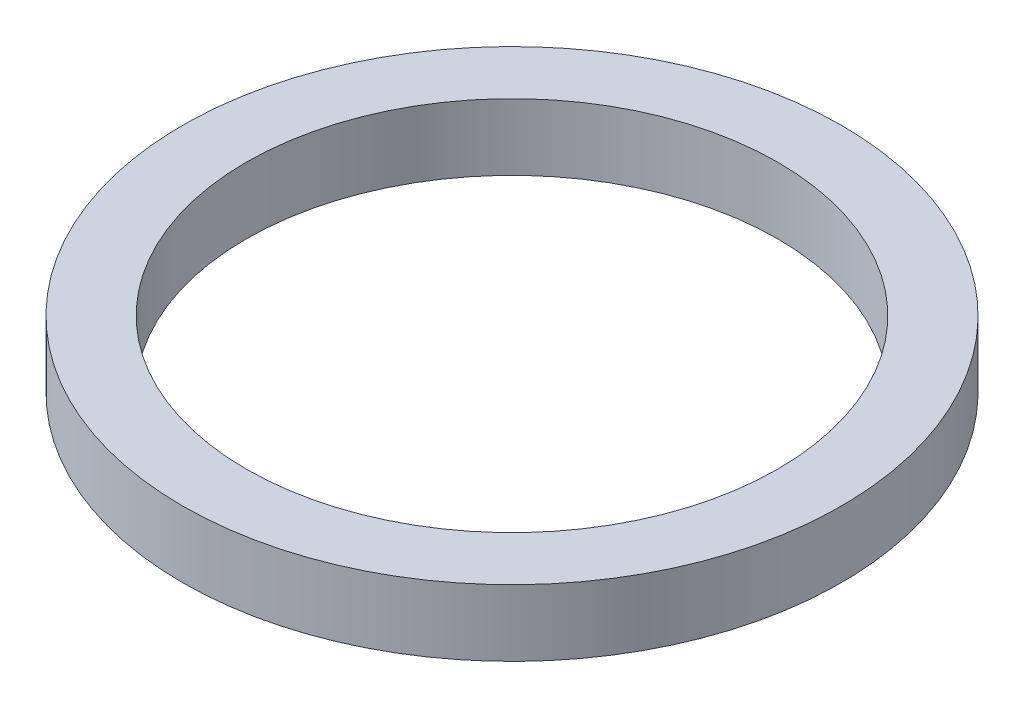
ISO-10303-21;
HEADER;
FILE_DESCRIPTION(('STEP AP214'),'2;1');
FILE_NAME('part.step','',(''),(''),'','','');
FILE_SCHEMA(('AUTOMOTIVE_DESIGN { 1 0 10303 214 1 1 1 1 }'));
ENDSEC;
DATA;
#1=APPLICATION_CONTEXT('core data for automotive mechanical design processes');
#2=APPLICATION_PROTOCOL_DEFINITION('international standard','automotive_design',2000,#1);
#3=PRODUCT_CONTEXT('',#1,'mechanical');
#4=PRODUCT('Part','Part','',(#3));
#5=PRODUCT_RELATED_PRODUCT_CATEGORY('part','',(#4));
#6=PRODUCT_DEFINITION_FORMATION('','',#4);
#7=PRODUCT_DEFINITION_CONTEXT('part definition',#1,'design');
#8=PRODUCT_DEFINITION('design','',#6,#7);
#9=PRODUCT_DEFINITION_SHAPE('','',#8);
#10=(LENGTH_UNIT() NAMED_UNIT(*) SI_UNIT(.MILLI.,.METRE.));
#11=(NAMED_UNIT(*) PLANE_ANGLE_UNIT() SI_UNIT($,.RADIAN.));
#12=(NAMED_UNIT(*) SI_UNIT($,.STERADIAN.) SOLID_ANGLE_UNIT());
#13=UNCERTAINTY_MEASURE_WITH_UNIT(LENGTH_MEASURE(1.E-05),#10,'distance_accuracy_value','');
#14=(GEOMETRIC_REPRESENTATION_CONTEXT(3) GLOBAL_UNCERTAINTY_ASSIGNED_CONTEXT((#13)) GLOBAL_UNIT_ASSIGNED_CONTEXT((#10,
#11,#12)) REPRESENTATION_CONTEXT('',''));
#15=CARTESIAN_POINT('',(0.,0.,0.));
#16=DIRECTION('',(0.,0.,1.));
#17=DIRECTION('',(1.,0.,0.));
#18=AXIS2_PLACEMENT_3D('',#15,#16,#17);
#19=CARTESIAN_POINT('',(0.,1.5875,0.));
#20=DIRECTION('',(0.,1.,0.));
#21=DIRECTION('',(0.,0.,1.));
#22=AXIS2_PLACEMENT_3D('',#19,#20,#21);
#23=PLANE('',#22);
#24=CARTESIAN_POINT('',(0.,1.5875,0.));
#25=DIRECTION('',(0.,1.,0.));
#26=DIRECTION('',(0.,0.,1.));
#27=AXIS2_PLACEMENT_3D('',#24,#25,#26);
#28=CIRCLE('',#27,7.874);
#29=CARTESIAN_POINT('',(0.,1.5875,7.874));
#30=VERTEX_POINT('',#29);
#31=EDGE_CURVE('E10',#30,#30,#28,.T.);
#32=ORIENTED_EDGE('',*,*,#31,.T.);
#33=EDGE_LOOP('',(#32));
#34=FACE_BOUND('',#33,.T.);
#35=CARTESIAN_POINT('',(0.,1.5875,0.));
#36=DIRECTION('',(0.,1.,0.));
#37=DIRECTION('',(0.,0.,1.));
#38=AXIS2_PLACEMENT_3D('',#35,#36,#37);
#39=CIRCLE('',#38,6.35);
#40=CARTESIAN_POINT('',(0.,1.5875,6.35));
#41=VERTEX_POINT('',#40);
#42=EDGE_CURVE('E42',#41,#41,#39,.T.);
#43=ORIENTED_EDGE('',*,*,#42,.F.);
#44=EDGE_LOOP('',(#43));
#45=FACE_BOUND('',#44,.T.);
#46=ADVANCED_FACE('F31',(#34,#45),#23,.T.);
#47=CARTESIAN_POINT('',(0.,0.,0.));
#48=DIRECTION('',(0.,1.,0.));
#49=DIRECTION('',(0.,0.,1.));
#50=AXIS2_PLACEMENT_3D('',#47,#48,#49);
#51=PLANE('',#50);
#52=CARTESIAN_POINT('',(0.,0.,0.));
#53=DIRECTION('',(0.,1.,0.));
#54=DIRECTION('',(0.,0.,1.));
#55=AXIS2_PLACEMENT_3D('',#52,#53,#54);
#56=CIRCLE('',#55,7.874);
#57=CARTESIAN_POINT('',(0.,0.,7.874));
#58=VERTEX_POINT('',#57);
#59=EDGE_CURVE('E35',#58,#58,#56,.T.);
#60=ORIENTED_EDGE('',*,*,#59,.F.);
#61=EDGE_LOOP('',(#60));
#62=FACE_BOUND('',#61,.T.);
#63=CARTESIAN_POINT('',(0.,0.,0.));
#64=DIRECTION('',(0.,1.,0.));
#65=DIRECTION('',(0.,0.,1.));
#66=AXIS2_PLACEMENT_3D('',#63,#64,#65);
#67=CIRCLE('',#66,6.35);
#68=CARTESIAN_POINT('',(0.,0.,6.35));
#69=VERTEX_POINT('',#68);
#70=EDGE_CURVE('E44',#69,#69,#67,.T.);
#71=ORIENTED_EDGE('',*,*,#70,.T.);
#72=EDGE_LOOP('',(#71));
#73=FACE_BOUND('',#72,.T.);
#74=ADVANCED_FACE('F54',(#62,#73),#51,.F.);
#75=CARTESIAN_POINT('',(0.,1.5875,0.));
#76=DIRECTION('',(0.,-1.,0.));
#77=DIRECTION('',(0.,0.,-1.));
#78=AXIS2_PLACEMENT_3D('',#75,#76,#77);
#79=CYLINDRICAL_SURFACE('',#78,7.874);
#80=ORIENTED_EDGE('',*,*,#31,.F.);
#81=EDGE_LOOP('',(#80));
#82=FACE_BOUND('',#81,.T.);
#83=ORIENTED_EDGE('',*,*,#59,.T.);
#84=EDGE_LOOP('',(#83));
#85=FACE_BOUND('',#84,.T.);
#86=ADVANCED_FACE('F33',(#82,#85),#79,.T.);
#87=CARTESIAN_POINT('',(0.,1.5875,0.));
#88=DIRECTION('',(0.,-1.,0.));
#89=DIRECTION('',(0.,0.,-1.));
#90=AXIS2_PLACEMENT_3D('',#87,#88,#89);
#91=CYLINDRICAL_SURFACE('',#90,6.35);
#92=ORIENTED_EDGE('',*,*,#42,.T.);
#93=EDGE_LOOP('',(#92));
#94=FACE_BOUND('',#93,.T.);
#95=ORIENTED_EDGE('',*,*,#70,.F.);
#96=EDGE_LOOP('',(#95));
#97=FACE_BOUND('',#96,.T.);
#98=ADVANCED_FACE('F50',(#94,#97),#91,.F.);
#99=CLOSED_SHELL('',(#46,#74,#86,#98));
#100=MANIFOLD_SOLID_BREP('B2',#99);
#101=ADVANCED_BREP_SHAPE_REPRESENTATION('',(#18,#100),#14);
#102=SHAPE_DEFINITION_REPRESENTATION(#9,#101);
ENDSEC;
END-ISO-10303-21;
